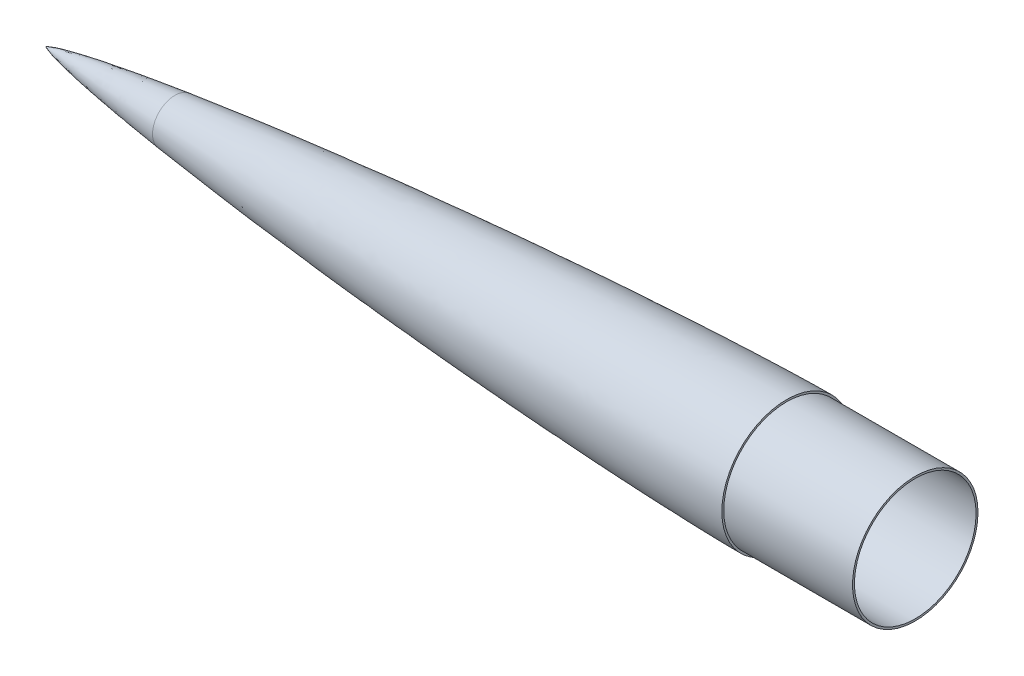
ISO-10303-21;
HEADER;
FILE_DESCRIPTION(('STEP AP214'),'2;1');
FILE_NAME('part.step','',(''),(''),'','','');
FILE_SCHEMA(('AUTOMOTIVE_DESIGN { 1 0 10303 214 1 1 1 1 }'));
ENDSEC;
DATA;
#1=APPLICATION_CONTEXT('core data for automotive mechanical design processes');
#2=APPLICATION_PROTOCOL_DEFINITION('international standard','automotive_design',2000,#1);
#3=PRODUCT_CONTEXT('',#1,'mechanical');
#4=PRODUCT('Part','Part','',(#3));
#5=PRODUCT_RELATED_PRODUCT_CATEGORY('part','',(#4));
#6=PRODUCT_DEFINITION_FORMATION('','',#4);
#7=PRODUCT_DEFINITION_CONTEXT('part definition',#1,'design');
#8=PRODUCT_DEFINITION('design','',#6,#7);
#9=PRODUCT_DEFINITION_SHAPE('','',#8);
#10=(LENGTH_UNIT() NAMED_UNIT(*) SI_UNIT(.MILLI.,.METRE.));
#11=(NAMED_UNIT(*) PLANE_ANGLE_UNIT() SI_UNIT($,.RADIAN.));
#12=(NAMED_UNIT(*) SI_UNIT($,.STERADIAN.) SOLID_ANGLE_UNIT());
#13=UNCERTAINTY_MEASURE_WITH_UNIT(LENGTH_MEASURE(1.E-05),#10,'distance_accuracy_value','');
#14=(GEOMETRIC_REPRESENTATION_CONTEXT(3) GLOBAL_UNCERTAINTY_ASSIGNED_CONTEXT((#13)) GLOBAL_UNIT_ASSIGNED_CONTEXT((#10,
#11,#12)) REPRESENTATION_CONTEXT('',''));
#15=CARTESIAN_POINT('',(0.,0.,0.));
#16=DIRECTION('',(0.,0.,1.));
#17=DIRECTION('',(1.,0.,0.));
#18=AXIS2_PLACEMENT_3D('',#15,#16,#17);
#19=CARTESIAN_POINT('',(101.714821416347,0.,0.));
#20=DIRECTION('',(1.,0.,0.));
#21=DIRECTION('',(0.,0.,-1.));
#22=AXIS2_PLACEMENT_3D('',#19,#20,#21);
#23=PLANE('',#22);
#24=CARTESIAN_POINT('',(101.714821416347,0.,0.));
#25=DIRECTION('',(1.,0.,0.));
#26=DIRECTION('',(0.,0.,-1.));
#27=AXIS2_PLACEMENT_3D('',#24,#25,#26);
#28=CIRCLE('',#27,15.1018847619902);
#29=CARTESIAN_POINT('',(101.714821416347,0.,-15.1018847619902));
#30=VERTEX_POINT('',#29);
#31=EDGE_CURVE('E86',#30,#30,#28,.T.);
#32=ORIENTED_EDGE('',*,*,#31,.F.);
#33=EDGE_LOOP('',(#32));
#34=FACE_BOUND('',#33,.T.);
#35=CARTESIAN_POINT('',(101.714821416347,0.,0.));
#36=DIRECTION('',(-1.,0.,0.));
#37=DIRECTION('',(0.,0.,1.));
#38=AXIS2_PLACEMENT_3D('',#35,#36,#37);
#39=CIRCLE('',#38,17.6418847619902);
#40=CARTESIAN_POINT('',(101.714821416347,0.,17.6418847619902));
#41=VERTEX_POINT('',#40);
#42=EDGE_CURVE('E12',#41,#41,#39,.T.);
#43=ORIENTED_EDGE('',*,*,#42,.F.);
#44=EDGE_LOOP('',(#43));
#45=FACE_BOUND('',#44,.T.);
#46=ADVANCED_FACE('F57',(#34,#45),#23,.T.);
#47=CARTESIAN_POINT('',(0.,0.,0.));
#48=CARTESIAN_POINT('',(0.00231322738484348,0.0055370346247521,0.));
#49=CARTESIAN_POINT('',(0.00783249312036859,0.016053526267405,0.));
#50=CARTESIAN_POINT('',(0.022724110721296,0.0347114630706125,0.));
#51=CARTESIAN_POINT('',(0.0568531101671376,0.0680376037869276,0.));
#52=CARTESIAN_POINT('',(0.107860338962889,0.109089546561085,0.));
#53=CARTESIAN_POINT('',(0.176297082755754,0.15664527512294,0.));
#54=CARTESIAN_POINT('',(0.273519160837279,0.217325898544174,0.));
#55=CARTESIAN_POINT('',(0.390215770108365,0.283297028853187,0.));
#56=CARTESIAN_POINT('',(0.527109214614797,0.354478000149602,0.));
#57=CARTESIAN_POINT('',(0.684247457227091,0.430489785080519,0.));
#58=CARTESIAN_POINT('',(0.91183956555971,0.534379577838225,0.));
#59=CARTESIAN_POINT('',(1.26558107372769,0.684303039451021,0.));
#60=CARTESIAN_POINT('',(1.86914279257801,0.918054245602526,0.));
#61=CARTESIAN_POINT('',(2.9548608655394,1.2955332422303,0.));
#62=CARTESIAN_POINT('',(4.90415259244947,1.895766605082,0.));
#63=CARTESIAN_POINT('',(8.46669906921795,2.85481962125989,0.));
#64=CARTESIAN_POINT('',(15.1297288871334,4.40624380169119,0.));
#65=CARTESIAN_POINT('',(26.8756797725386,6.74923099944328,0.));
#66=CARTESIAN_POINT('',(46.5534142804856,10.1148459584637,0.));
#67=CARTESIAN_POINT('',(73.3968729765829,14.0575837843687,0.));
#68=CARTESIAN_POINT('',(105.793845276797,18.2468759246633,0.));
#69=CARTESIAN_POINT('',(141.534381248982,22.384589439546,0.));
#70=CARTESIAN_POINT('',(177.314665969069,26.1597240113074,0.));
#71=CARTESIAN_POINT('',(213.125414152542,29.6332482296008,0.));
#72=CARTESIAN_POINT('',(248.960578677911,32.843874888112,0.));
#73=CARTESIAN_POINT('',(284.816409695044,35.8146181315857,0.));
#74=CARTESIAN_POINT('',(320.690178689896,38.5597970446431,0.));
#75=CARTESIAN_POINT('',(356.580031471637,41.0860394645037,0.));
#76=CARTESIAN_POINT('',(392.484577727304,43.3940570607543,0.));
#77=CARTESIAN_POINT('',(428.402852541319,45.4779222922057,0.));
#78=CARTESIAN_POINT('',(464.334166317329,47.3241324456903,0.));
#79=CARTESIAN_POINT('',(495.785103304392,48.7096716998088,0.));
#80=CARTESIAN_POINT('',(522.750798671369,49.7051633356234,0.));
#81=CARTESIAN_POINT('',(544.49275419667,50.3560805402911,0.));
#82=CARTESIAN_POINT('',(559.126811194722,50.7060019382127,0.));
#83=CARTESIAN_POINT('',(571.147030435037,50.919219199201,0.));
#84=CARTESIAN_POINT('',(578.671323684184,51.0023008390983,0.));
#85=CARTESIAN_POINT('',(582.433637825642,51.025782200597,0.));
#86=CARTESIAN_POINT('',(584.314821416347,51.025782200597,0.));
#87=B_SPLINE_CURVE_WITH_KNOTS('',4,(#47,#48,#49,#50,#51,#52,#53,#54,#55,#56,#57,#58,#59,#60,#61,
#62,#63,#64,#65,#66,#67,#68,#69,#70,#71,#72,#73,#74,#75,#76,#77,#78,#79,#80,#81,#82,#83,#84,#85,
#86),.UNSPECIFIED.,.F.,.F.,(5,1,1,1,1,1,1,1,1,1,1,1,1,1,1,1,1,1,1,1,1,1,1,1,1,1,1,1,1,1,1,1,1,1,
1,1,5),(0.,4.05034635415651E-05,8.10069270831303E-05,0.000162013854166261,0.000324027708332521,
0.000486041562498782,0.000648055416665042,0.000942335101440684,0.00123661478621633,
0.00153662508854197,0.00183663539086761,0.00264596964701436,0.00385258932396449,
0.00594355874642908,0.00966287650883994,0.0165328614034853,0.0289722007853516,
0.0525243647796248,0.0912164543106719,0.152469343784786,0.213722241064171,0.274975138122805,
0.336228034858462,0.397480931501002,0.458733828059114,0.519986725416448,0.581239622718951,
0.642492519829032,0.703745416700991,0.764998313276774,0.826251210376521,0.887504107718463,
0.918130556153108,0.948757004587752,0.974378502293876,0.987189251146938,1.),.UNSPECIFIED.);
#88=CARTESIAN_POINT('',(0.,0.,0.));
#89=DIRECTION('',(-1.,0.,0.));
#90=AXIS1_PLACEMENT('',#88,#89);
#91=SURFACE_OF_REVOLUTION('',#87,#90);
#92=CARTESIAN_POINT('',(0.,0.,0.));
#93=VERTEX_POINT('',#92);
#94=VERTEX_LOOP('',#93);
#95=FACE_BOUND('',#94,.T.);
#96=ORIENTED_EDGE('',*,*,#42,.T.);
#97=EDGE_LOOP('',(#96));
#98=FACE_BOUND('',#97,.T.);
#99=ADVANCED_FACE('F59',(#95,#98),#91,.F.);
#100=CARTESIAN_POINT('',(114.414821416347,0.,0.));
#101=DIRECTION('',(-1.,0.,0.));
#102=DIRECTION('',(0.,0.,1.));
#103=AXIS2_PLACEMENT_3D('',#100,#101,#102);
#104=CYLINDRICAL_SURFACE('',#103,15.1018847619902);
#105=CARTESIAN_POINT('',(114.414821416347,0.,0.));
#106=DIRECTION('',(1.,0.,0.));
#107=DIRECTION('',(0.,0.,-1.));
#108=AXIS2_PLACEMENT_3D('',#105,#106,#107);
#109=CIRCLE('',#108,15.1018847619902);
#110=CARTESIAN_POINT('',(114.414821416347,0.,-15.1018847619902));
#111=VERTEX_POINT('',#110);
#112=EDGE_CURVE('E69',#111,#111,#109,.T.);
#113=ORIENTED_EDGE('',*,*,#112,.F.);
#114=EDGE_LOOP('',(#113));
#115=FACE_BOUND('',#114,.T.);
#116=ORIENTED_EDGE('',*,*,#31,.T.);
#117=EDGE_LOOP('',(#116));
#118=FACE_BOUND('',#117,.T.);
#119=ADVANCED_FACE('F101',(#115,#118),#104,.T.);
#120=CARTESIAN_POINT('',(114.414821416347,0.,0.));
#121=DIRECTION('',(1.,0.,0.));
#122=DIRECTION('',(0.,0.,-1.));
#123=AXIS2_PLACEMENT_3D('',#120,#121,#122);
#124=PLANE('',#123);
#125=CARTESIAN_POINT('',(114.414821416347,0.,0.));
#126=DIRECTION('',(1.,0.,0.));
#127=DIRECTION('',(0.,0.,-1.));
#128=AXIS2_PLACEMENT_3D('',#125,#126,#127);
#129=CIRCLE('',#128,3.17499999999999);
#130=CARTESIAN_POINT('',(114.414821416347,0.,-3.17499999999999));
#131=VERTEX_POINT('',#130);
#132=EDGE_CURVE('E87',#131,#131,#129,.T.);
#133=ORIENTED_EDGE('',*,*,#132,.F.);
#134=EDGE_LOOP('',(#133));
#135=FACE_BOUND('',#134,.T.);
#136=ORIENTED_EDGE('',*,*,#112,.T.);
#137=EDGE_LOOP('',(#136));
#138=FACE_BOUND('',#137,.T.);
#139=ADVANCED_FACE('F79',(#135,#138),#124,.T.);
#140=CARTESIAN_POINT('',(63.6148214163468,0.,0.));
#141=DIRECTION('',(1.,0.,0.));
#142=DIRECTION('',(0.,0.,-1.));
#143=AXIS2_PLACEMENT_3D('',#140,#141,#142);
#144=CONICAL_SURFACE('',#143,3.17499999999998,1.02974425867665);
#145=CARTESIAN_POINT('',(61.7070889509343,0.,0.));
#146=VERTEX_POINT('',#145);
#147=VERTEX_LOOP('',#146);
#148=FACE_BOUND('',#147,.T.);
#149=CARTESIAN_POINT('',(63.6148214163468,0.,0.));
#150=DIRECTION('',(1.,0.,0.));
#151=DIRECTION('',(0.,0.,-1.));
#152=AXIS2_PLACEMENT_3D('',#149,#150,#151);
#153=CIRCLE('',#152,3.17499999999998);
#154=CARTESIAN_POINT('',(63.6148214163468,0.,-3.17499999999998));
#155=VERTEX_POINT('',#154);
#156=EDGE_CURVE('E83',#155,#155,#153,.T.);
#157=ORIENTED_EDGE('',*,*,#156,.T.);
#158=EDGE_LOOP('',(#157));
#159=FACE_BOUND('',#158,.T.);
#160=ADVANCED_FACE('F75',(#148,#159),#144,.F.);
#161=CARTESIAN_POINT('',(114.414821416347,0.,0.));
#162=DIRECTION('',(1.,0.,0.));
#163=DIRECTION('',(0.,0.,-1.));
#164=AXIS2_PLACEMENT_3D('',#161,#162,#163);
#165=CYLINDRICAL_SURFACE('',#164,3.17499999999999);
#166=ORIENTED_EDGE('',*,*,#156,.F.);
#167=EDGE_LOOP('',(#166));
#168=FACE_BOUND('',#167,.T.);
#169=ORIENTED_EDGE('',*,*,#132,.T.);
#170=EDGE_LOOP('',(#169));
#171=FACE_BOUND('',#170,.T.);
#172=ADVANCED_FACE('F78',(#168,#171),#165,.F.);
#173=CLOSED_SHELL('',(#46,#99,#119,#139,#160,#172));
#174=MANIFOLD_SOLID_BREP('B2',#173);
#175=CARTESIAN_POINT('',(101.714821416347,0.,0.));
#176=DIRECTION('',(1.,0.,0.));
#177=DIRECTION('',(0.,0.,-1.));
#178=AXIS2_PLACEMENT_3D('',#175,#176,#177);
#179=PLANE('',#178);
#180=CARTESIAN_POINT('',(101.714821416347,0.,0.));
#181=DIRECTION('',(-1.,0.,0.));
#182=DIRECTION('',(0.,0.,1.));
#183=AXIS2_PLACEMENT_3D('',#180,#181,#182);
#184=CIRCLE('',#183,17.6418847619902);
#185=CARTESIAN_POINT('',(101.714821416347,0.,17.6418847619902));
#186=VERTEX_POINT('',#185);
#187=EDGE_CURVE('E56',#186,#186,#184,.T.);
#188=ORIENTED_EDGE('',*,*,#187,.T.);
#189=EDGE_LOOP('',(#188));
#190=FACE_BOUND('',#189,.T.);
#191=CARTESIAN_POINT('',(101.714821416347,0.,0.));
#192=DIRECTION('',(-1.,0.,0.));
#193=DIRECTION('',(0.,0.,1.));
#194=AXIS2_PLACEMENT_3D('',#191,#192,#193);
#195=CIRCLE('',#194,16.1061369689898);
#196=CARTESIAN_POINT('',(101.714821416347,0.,16.1061369689898));
#197=VERTEX_POINT('',#196);
#198=EDGE_CURVE('E169',#197,#197,#195,.T.);
#199=ORIENTED_EDGE('',*,*,#198,.F.);
#200=EDGE_LOOP('',(#199));
#201=FACE_BOUND('',#200,.T.);
#202=ADVANCED_FACE('F163',(#190,#201),#179,.F.);
#203=CARTESIAN_POINT('',(685.914821416347,0.,0.));
#204=DIRECTION('',(1.,0.,0.));
#205=DIRECTION('',(0.,0.,-1.));
#206=AXIS2_PLACEMENT_3D('',#203,#204,#205);
#207=PLANE('',#206);
#208=CARTESIAN_POINT('',(685.914821416347,0.,0.));
#209=DIRECTION('',(1.,0.,0.));
#210=DIRECTION('',(0.,0.,-1.));
#211=AXIS2_PLACEMENT_3D('',#208,#209,#210);
#212=CIRCLE('',#211,49.5017822005971);
#213=CARTESIAN_POINT('',(685.914821416347,0.,-49.5017822005971));
#214=VERTEX_POINT('',#213);
#215=EDGE_CURVE('E228',#214,#214,#212,.T.);
#216=ORIENTED_EDGE('',*,*,#215,.T.);
#217=EDGE_LOOP('',(#216));
#218=FACE_BOUND('',#217,.T.);
#219=CARTESIAN_POINT('',(685.914821416347,0.,0.));
#220=DIRECTION('',(1.,0.,0.));
#221=DIRECTION('',(0.,0.,-1.));
#222=AXIS2_PLACEMENT_3D('',#219,#220,#221);
#223=CIRCLE('',#222,47.9777822005971);
#224=CARTESIAN_POINT('',(685.914821416347,0.,-47.9777822005971));
#225=VERTEX_POINT('',#224);
#226=EDGE_CURVE('E231',#225,#225,#223,.T.);
#227=ORIENTED_EDGE('',*,*,#226,.F.);
#228=EDGE_LOOP('',(#227));
#229=FACE_BOUND('',#228,.T.);
#230=ADVANCED_FACE('F218',(#218,#229),#207,.T.);
#231=CARTESIAN_POINT('',(558.914821416347,0.,0.));
#232=DIRECTION('',(1.,0.,0.));
#233=DIRECTION('',(0.,0.,-1.));
#234=AXIS2_PLACEMENT_3D('',#231,#232,#233);
#235=CYLINDRICAL_SURFACE('',#234,47.9777822005971);
#236=CARTESIAN_POINT('',(558.914821416347,0.,0.));
#237=DIRECTION('',(1.,0.,0.));
#238=DIRECTION('',(0.,0.,-1.));
#239=AXIS2_PLACEMENT_3D('',#236,#237,#238);
#240=CIRCLE('',#239,47.9777822005971);
#241=CARTESIAN_POINT('',(558.914821416347,0.,-47.9777822005971));
#242=VERTEX_POINT('',#241);
#243=EDGE_CURVE('E234',#242,#242,#240,.T.);
#244=ORIENTED_EDGE('',*,*,#243,.F.);
#245=EDGE_LOOP('',(#244));
#246=FACE_BOUND('',#245,.T.);
#247=ORIENTED_EDGE('',*,*,#226,.T.);
#248=EDGE_LOOP('',(#247));
#249=FACE_BOUND('',#248,.T.);
#250=ADVANCED_FACE('F214',(#246,#249),#235,.F.);
#251=CARTESIAN_POINT('',(558.914821416347,0.,0.));
#252=DIRECTION('',(1.,0.,0.));
#253=DIRECTION('',(0.,0.,-1.));
#254=AXIS2_PLACEMENT_3D('',#251,#252,#253);
#255=PLANE('',#254);
#256=ORIENTED_EDGE('',*,*,#243,.T.);
#257=EDGE_LOOP('',(#256));
#258=FACE_BOUND('',#257,.T.);
#259=CARTESIAN_POINT('',(558.914821416347,0.,0.));
#260=DIRECTION('',(-1.,0.,0.));
#261=DIRECTION('',(0.,0.,1.));
#262=AXIS2_PLACEMENT_3D('',#259,#260,#261);
#263=CIRCLE('',#262,49.1589994163911);
#264=CARTESIAN_POINT('',(558.914821416347,0.,49.1589994163911));
#265=VERTEX_POINT('',#264);
#266=EDGE_CURVE('E173',#265,#265,#263,.T.);
#267=ORIENTED_EDGE('',*,*,#266,.T.);
#268=EDGE_LOOP('',(#267));
#269=FACE_BOUND('',#268,.T.);
#270=ADVANCED_FACE('F208',(#258,#269),#255,.F.);
#271=CARTESIAN_POINT('',(3.49013330859936,1.4549232757151,0.));
#272=CARTESIAN_POINT('',(3.93678098244876,1.59418139029307,0.));
#273=CARTESIAN_POINT('',(5.35196705647839,2.0162559823153,0.));
#274=CARTESIAN_POINT('',(8.54297473055206,2.87257969567138,0.));
#275=CARTESIAN_POINT('',(15.1297288871334,4.40624380169119,0.));
#276=CARTESIAN_POINT('',(26.8756797725386,6.74923099944328,0.));
#277=CARTESIAN_POINT('',(46.5534142804856,10.1148459584637,0.));
#278=CARTESIAN_POINT('',(73.3968729765829,14.0575837843687,0.));
#279=CARTESIAN_POINT('',(105.793845276797,18.2468759246633,0.));
#280=CARTESIAN_POINT('',(141.534381248982,22.384589439546,0.));
#281=CARTESIAN_POINT('',(177.314665969069,26.1597240113074,0.));
#282=CARTESIAN_POINT('',(213.125414152542,29.6332482296008,0.));
#283=CARTESIAN_POINT('',(248.960578677911,32.843874888112,0.));
#284=CARTESIAN_POINT('',(284.816409695044,35.8146181315857,0.));
#285=CARTESIAN_POINT('',(320.690178689896,38.5597970446431,0.));
#286=CARTESIAN_POINT('',(356.580031471637,41.0860394645037,0.));
#287=CARTESIAN_POINT('',(392.484577727304,43.3940570607543,0.));
#288=CARTESIAN_POINT('',(428.402852541319,45.4779222922057,0.));
#289=CARTESIAN_POINT('',(464.334166317329,47.3241324456903,0.));
#290=CARTESIAN_POINT('',(495.785103304392,48.7096716998088,0.));
#291=CARTESIAN_POINT('',(522.750798671369,49.7051633356234,0.));
#292=CARTESIAN_POINT('',(544.49275419667,50.3560805402911,0.));
#293=CARTESIAN_POINT('',(559.126811194722,50.7060019382127,0.));
#294=CARTESIAN_POINT('',(571.147030435037,50.919219199201,0.));
#295=CARTESIAN_POINT('',(578.671323684184,51.0023008390983,0.));
#296=CARTESIAN_POINT('',(582.433637825642,51.025782200597,0.));
#297=CARTESIAN_POINT('',(584.314821416347,51.025782200597,0.));
#298=B_SPLINE_CURVE_WITH_KNOTS('',4,(#271,#272,#273,#274,#275,#276,#277,#278,#279,#280,#281,
#282,#283,#284,#285,#286,#287,#288,#289,#290,#291,#292,#293,#294,#295,#296,#297),.UNSPECIFIED.,
.F.,.F.,(5,1,1,1,1,1,1,1,1,1,1,1,1,1,1,1,1,1,1,1,1,1,1,5),(0.00647679691026027,
0.00966287650883994,0.0165328614034853,0.0289722007853516,0.0525243647796248,0.0912164543106719,
0.152469343784786,0.213722241064171,0.274975138122805,0.336228034858462,0.397480931501002,
0.458733828059114,0.519986725416448,0.581239622718951,0.642492519829032,0.703745416700991,
0.764998313276774,0.826251210376521,0.887504107718463,0.918130556153108,0.948757004587752,
0.974378502293876,0.987189251146938,1.),.UNSPECIFIED.);
#299=CARTESIAN_POINT('',(0.,0.,0.));
#300=DIRECTION('',(-1.,0.,0.));
#301=AXIS1_PLACEMENT('',#299,#300);
#302=SURFACE_OF_REVOLUTION('',#298,#301);
#303=OFFSET_SURFACE('',#302,1.524,.F.);
#304=ORIENTED_EDGE('',*,*,#198,.T.);
#305=EDGE_LOOP('',(#304));
#306=FACE_BOUND('',#305,.T.);
#307=ORIENTED_EDGE('',*,*,#266,.F.);
#308=EDGE_LOOP('',(#307));
#309=FACE_BOUND('',#308,.T.);
#310=ADVANCED_FACE('F205',(#306,#309),#303,.T.);
#311=CARTESIAN_POINT('',(558.914821416347,0.,0.));
#312=DIRECTION('',(1.,0.,0.));
#313=DIRECTION('',(0.,0.,-1.));
#314=AXIS2_PLACEMENT_3D('',#311,#312,#313);
#315=CYLINDRICAL_SURFACE('',#314,49.5017822005971);
#316=ORIENTED_EDGE('',*,*,#215,.F.);
#317=EDGE_LOOP('',(#316));
#318=FACE_BOUND('',#317,.T.);
#319=CARTESIAN_POINT('',(584.314821416347,0.,0.));
#320=DIRECTION('',(-1.,0.,0.));
#321=DIRECTION('',(0.,0.,1.));
#322=AXIS2_PLACEMENT_3D('',#319,#320,#321);
#323=CIRCLE('',#322,49.501782200597);
#324=CARTESIAN_POINT('',(584.314821416347,0.,49.501782200597));
#325=VERTEX_POINT('',#324);
#326=EDGE_CURVE('E182',#325,#325,#323,.T.);
#327=ORIENTED_EDGE('',*,*,#326,.F.);
#328=EDGE_LOOP('',(#327));
#329=FACE_BOUND('',#328,.T.);
#330=ADVANCED_FACE('F201',(#318,#329),#315,.T.);
#331=CARTESIAN_POINT('',(584.314821416347,-1.27135683254371E-12,0.));
#332=DIRECTION('',(1.,0.,0.));
#333=DIRECTION('',(0.,0.,-1.));
#334=AXIS2_PLACEMENT_3D('',#331,#332,#333);
#335=PLANE('',#334);
#336=ORIENTED_EDGE('',*,*,#326,.T.);
#337=EDGE_LOOP('',(#336));
#338=FACE_BOUND('',#337,.T.);
#339=CARTESIAN_POINT('',(584.314821416347,0.,0.));
#340=DIRECTION('',(-1.,0.,0.));
#341=DIRECTION('',(0.,0.,1.));
#342=AXIS2_PLACEMENT_3D('',#339,#340,#341);
#343=CIRCLE('',#342,51.025782200597);
#344=CARTESIAN_POINT('',(584.314821416347,0.,51.025782200597));
#345=VERTEX_POINT('',#344);
#346=EDGE_CURVE('E177',#345,#345,#343,.T.);
#347=ORIENTED_EDGE('',*,*,#346,.F.);
#348=EDGE_LOOP('',(#347));
#349=FACE_BOUND('',#348,.T.);
#350=ADVANCED_FACE('F197',(#338,#349),#335,.T.);
#351=CARTESIAN_POINT('',(0.,0.,0.));
#352=CARTESIAN_POINT('',(0.00231322738484348,0.0055370346247521,0.));
#353=CARTESIAN_POINT('',(0.00783249312036859,0.016053526267405,0.));
#354=CARTESIAN_POINT('',(0.022724110721296,0.0347114630706125,0.));
#355=CARTESIAN_POINT('',(0.0568531101671376,0.0680376037869276,0.));
#356=CARTESIAN_POINT('',(0.107860338962889,0.109089546561085,0.));
#357=CARTESIAN_POINT('',(0.176297082755754,0.15664527512294,0.));
#358=CARTESIAN_POINT('',(0.273519160837279,0.217325898544174,0.));
#359=CARTESIAN_POINT('',(0.390215770108365,0.283297028853187,0.));
#360=CARTESIAN_POINT('',(0.527109214614797,0.354478000149602,0.));
#361=CARTESIAN_POINT('',(0.684247457227091,0.430489785080519,0.));
#362=CARTESIAN_POINT('',(0.91183956555971,0.534379577838225,0.));
#363=CARTESIAN_POINT('',(1.26558107372769,0.684303039451021,0.));
#364=CARTESIAN_POINT('',(1.86914279257801,0.918054245602526,0.));
#365=CARTESIAN_POINT('',(2.9548608655394,1.2955332422303,0.));
#366=CARTESIAN_POINT('',(4.90415259244947,1.895766605082,0.));
#367=CARTESIAN_POINT('',(8.46669906921795,2.85481962125989,0.));
#368=CARTESIAN_POINT('',(15.1297288871334,4.40624380169119,0.));
#369=CARTESIAN_POINT('',(26.8756797725386,6.74923099944328,0.));
#370=CARTESIAN_POINT('',(46.5534142804856,10.1148459584637,0.));
#371=CARTESIAN_POINT('',(73.3968729765829,14.0575837843687,0.));
#372=CARTESIAN_POINT('',(105.793845276797,18.2468759246633,0.));
#373=CARTESIAN_POINT('',(141.534381248982,22.384589439546,0.));
#374=CARTESIAN_POINT('',(177.314665969069,26.1597240113074,0.));
#375=CARTESIAN_POINT('',(213.125414152542,29.6332482296008,0.));
#376=CARTESIAN_POINT('',(248.960578677911,32.843874888112,0.));
#377=CARTESIAN_POINT('',(284.816409695044,35.8146181315857,0.));
#378=CARTESIAN_POINT('',(320.690178689896,38.5597970446431,0.));
#379=CARTESIAN_POINT('',(356.580031471637,41.0860394645037,0.));
#380=CARTESIAN_POINT('',(392.484577727304,43.3940570607543,0.));
#381=CARTESIAN_POINT('',(428.402852541319,45.4779222922057,0.));
#382=CARTESIAN_POINT('',(464.334166317329,47.3241324456903,0.));
#383=CARTESIAN_POINT('',(495.785103304392,48.7096716998088,0.));
#384=CARTESIAN_POINT('',(522.750798671369,49.7051633356234,0.));
#385=CARTESIAN_POINT('',(544.49275419667,50.3560805402911,0.));
#386=CARTESIAN_POINT('',(559.126811194722,50.7060019382127,0.));
#387=CARTESIAN_POINT('',(571.147030435037,50.919219199201,0.));
#388=CARTESIAN_POINT('',(578.671323684184,51.0023008390983,0.));
#389=CARTESIAN_POINT('',(582.433637825642,51.025782200597,0.));
#390=CARTESIAN_POINT('',(584.314821416347,51.025782200597,0.));
#391=B_SPLINE_CURVE_WITH_KNOTS('',4,(#351,#352,#353,#354,#355,#356,#357,#358,#359,#360,#361,
#362,#363,#364,#365,#366,#367,#368,#369,#370,#371,#372,#373,#374,#375,#376,#377,#378,#379,#380,
#381,#382,#383,#384,#385,#386,#387,#388,#389,#390),.UNSPECIFIED.,.F.,.F.,(5,1,1,1,1,1,1,1,1,1,1,
1,1,1,1,1,1,1,1,1,1,1,1,1,1,1,1,1,1,1,1,1,1,1,1,1,5),(0.,4.05034635415651E-05,
8.10069270831303E-05,0.000162013854166261,0.000324027708332521,0.000486041562498782,
0.000648055416665042,0.000942335101440684,0.00123661478621633,0.00153662508854197,
0.00183663539086761,0.00264596964701436,0.00385258932396449,0.00594355874642908,
0.00966287650883994,0.0165328614034853,0.0289722007853516,0.0525243647796248,0.0912164543106719,
0.152469343784786,0.213722241064171,0.274975138122805,0.336228034858462,0.397480931501002,
0.458733828059114,0.519986725416448,0.581239622718951,0.642492519829032,0.703745416700991,
0.764998313276774,0.826251210376521,0.887504107718463,0.918130556153108,0.948757004587752,
0.974378502293876,0.987189251146938,1.),.UNSPECIFIED.);
#392=CARTESIAN_POINT('',(0.,0.,0.));
#393=DIRECTION('',(-1.,0.,0.));
#394=AXIS1_PLACEMENT('',#392,#393);
#395=SURFACE_OF_REVOLUTION('',#391,#394);
#396=ORIENTED_EDGE('',*,*,#187,.F.);
#397=EDGE_LOOP('',(#396));
#398=FACE_BOUND('',#397,.T.);
#399=ORIENTED_EDGE('',*,*,#346,.T.);
#400=EDGE_LOOP('',(#399));
#401=FACE_BOUND('',#400,.T.);
#402=ADVANCED_FACE('F194',(#398,#401),#395,.F.);
#403=CLOSED_SHELL('',(#202,#230,#250,#270,#310,#330,#350,#402));
#404=MANIFOLD_SOLID_BREP('B6',#403);
#405=ADVANCED_BREP_SHAPE_REPRESENTATION('',(#18,#174,#404),#14);
#406=SHAPE_DEFINITION_REPRESENTATION(#9,#405);
ENDSEC;
END-ISO-10303-21;
